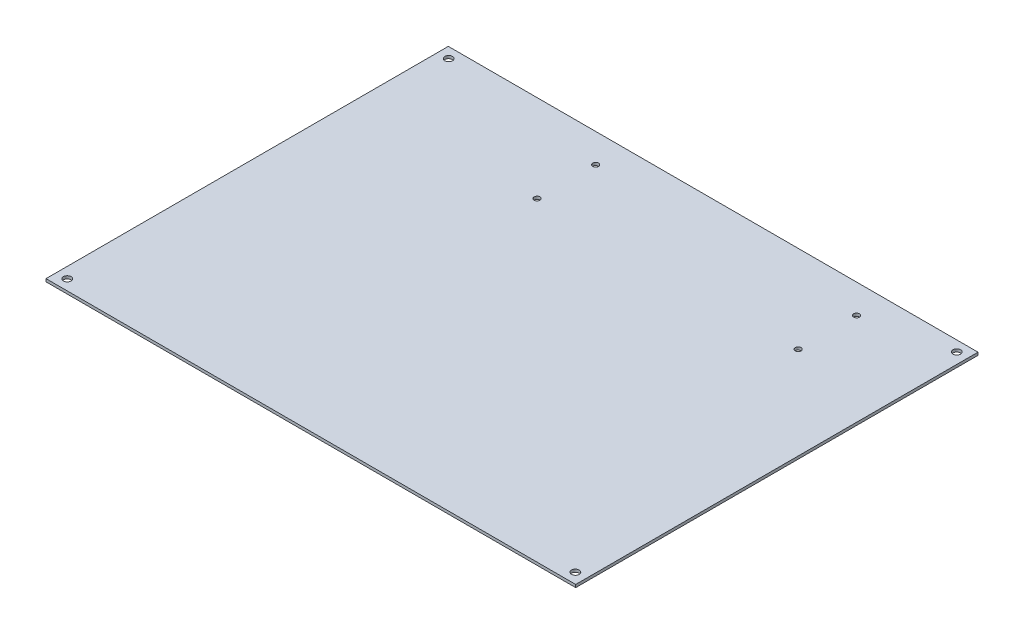
ISO-10303-21;
HEADER;
FILE_DESCRIPTION(('STEP AP214'),'2;1');
FILE_NAME('part.step','',(''),(''),'','','');
FILE_SCHEMA(('AUTOMOTIVE_DESIGN { 1 0 10303 214 1 1 1 1 }'));
ENDSEC;
DATA;
#1=APPLICATION_CONTEXT('core data for automotive mechanical design processes');
#2=APPLICATION_PROTOCOL_DEFINITION('international standard','automotive_design',2000,#1);
#3=PRODUCT_CONTEXT('',#1,'mechanical');
#4=PRODUCT('Part','Part','',(#3));
#5=PRODUCT_RELATED_PRODUCT_CATEGORY('part','',(#4));
#6=PRODUCT_DEFINITION_FORMATION('','',#4);
#7=PRODUCT_DEFINITION_CONTEXT('part definition',#1,'design');
#8=PRODUCT_DEFINITION('design','',#6,#7);
#9=PRODUCT_DEFINITION_SHAPE('','',#8);
#10=(LENGTH_UNIT() NAMED_UNIT(*) SI_UNIT(.MILLI.,.METRE.));
#11=(NAMED_UNIT(*) PLANE_ANGLE_UNIT() SI_UNIT($,.RADIAN.));
#12=(NAMED_UNIT(*) SI_UNIT($,.STERADIAN.) SOLID_ANGLE_UNIT());
#13=UNCERTAINTY_MEASURE_WITH_UNIT(LENGTH_MEASURE(1.E-05),#10,'distance_accuracy_value','');
#14=(GEOMETRIC_REPRESENTATION_CONTEXT(3) GLOBAL_UNCERTAINTY_ASSIGNED_CONTEXT((#13)) GLOBAL_UNIT_ASSIGNED_CONTEXT((#10,
#11,#12)) REPRESENTATION_CONTEXT('',''));
#15=CARTESIAN_POINT('',(0.,0.,0.));
#16=DIRECTION('',(0.,0.,1.));
#17=DIRECTION('',(1.,0.,0.));
#18=AXIS2_PLACEMENT_3D('',#15,#16,#17);
#19=CARTESIAN_POINT('',(-190.25,2.,-144.5));
#20=DIRECTION('',(1.,0.,0.));
#21=DIRECTION('',(0.,0.,-1.));
#22=AXIS2_PLACEMENT_3D('',#19,#20,#21);
#23=PLANE('',#22);
#24=DIRECTION('',(0.,0.,1.));
#25=VECTOR('',#24,1.);
#26=CARTESIAN_POINT('',(-190.25,0.,-144.5));
#27=LINE('',#26,#25);
#28=CARTESIAN_POINT('',(-190.25,0.,-144.5));
#29=VERTEX_POINT('',#28);
#30=CARTESIAN_POINT('',(-190.25,0.,144.5));
#31=VERTEX_POINT('',#30);
#32=EDGE_CURVE('E95',#29,#31,#27,.T.);
#33=ORIENTED_EDGE('',*,*,#32,.T.);
#34=DIRECTION('',(0.,-1.,0.));
#35=VECTOR('',#34,1.);
#36=CARTESIAN_POINT('',(-190.25,2.,144.5));
#37=LINE('',#36,#35);
#38=CARTESIAN_POINT('',(-190.25,2.,144.5));
#39=VERTEX_POINT('',#38);
#40=EDGE_CURVE('E11',#39,#31,#37,.T.);
#41=ORIENTED_EDGE('',*,*,#40,.F.);
#42=DIRECTION('',(0.,0.,1.));
#43=VECTOR('',#42,1.);
#44=CARTESIAN_POINT('',(-190.25,2.,-144.5));
#45=LINE('',#44,#43);
#46=CARTESIAN_POINT('',(-190.25,2.,-144.5));
#47=VERTEX_POINT('',#46);
#48=EDGE_CURVE('E83',#47,#39,#45,.T.);
#49=ORIENTED_EDGE('',*,*,#48,.F.);
#50=DIRECTION('',(0.,-1.,0.));
#51=VECTOR('',#50,1.);
#52=CARTESIAN_POINT('',(-190.25,2.,-144.5));
#53=LINE('',#52,#51);
#54=EDGE_CURVE('E91',#47,#29,#53,.T.);
#55=ORIENTED_EDGE('',*,*,#54,.T.);
#56=EDGE_LOOP('',(#33,#41,#49,#55));
#57=FACE_BOUND('',#56,.T.);
#58=ADVANCED_FACE('F32',(#57),#23,.F.);
#59=CARTESIAN_POINT('',(-190.25,2.,144.5));
#60=DIRECTION('',(0.,0.,-1.));
#61=DIRECTION('',(-1.,0.,0.));
#62=AXIS2_PLACEMENT_3D('',#59,#60,#61);
#63=PLANE('',#62);
#64=DIRECTION('',(1.,0.,0.));
#65=VECTOR('',#64,1.);
#66=CARTESIAN_POINT('',(-190.25,0.,144.5));
#67=LINE('',#66,#65);
#68=CARTESIAN_POINT('',(190.25,0.,144.5));
#69=VERTEX_POINT('',#68);
#70=EDGE_CURVE('E87',#31,#69,#67,.T.);
#71=ORIENTED_EDGE('',*,*,#70,.T.);
#72=DIRECTION('',(0.,-1.,0.));
#73=VECTOR('',#72,1.);
#74=CARTESIAN_POINT('',(190.25,2.,144.5));
#75=LINE('',#74,#73);
#76=CARTESIAN_POINT('',(190.25,2.,144.5));
#77=VERTEX_POINT('',#76);
#78=EDGE_CURVE('E40',#77,#69,#75,.T.);
#79=ORIENTED_EDGE('',*,*,#78,.F.);
#80=DIRECTION('',(1.,0.,0.));
#81=VECTOR('',#80,1.);
#82=CARTESIAN_POINT('',(-190.25,2.,144.5));
#83=LINE('',#82,#81);
#84=EDGE_CURVE('E78',#39,#77,#83,.T.);
#85=ORIENTED_EDGE('',*,*,#84,.F.);
#86=ORIENTED_EDGE('',*,*,#40,.T.);
#87=EDGE_LOOP('',(#71,#79,#85,#86));
#88=FACE_BOUND('',#87,.T.);
#89=ADVANCED_FACE('F86',(#88),#63,.F.);
#90=CARTESIAN_POINT('',(190.25,2.,-144.5));
#91=DIRECTION('',(-1.,0.,0.));
#92=DIRECTION('',(0.,0.,1.));
#93=AXIS2_PLACEMENT_3D('',#90,#91,#92);
#94=PLANE('',#93);
#95=DIRECTION('',(0.,0.,-1.));
#96=VECTOR('',#95,1.);
#97=CARTESIAN_POINT('',(190.25,0.,-144.5));
#98=LINE('',#97,#96);
#99=CARTESIAN_POINT('',(190.25,0.,-144.5));
#100=VERTEX_POINT('',#99);
#101=EDGE_CURVE('E65',#69,#100,#98,.T.);
#102=ORIENTED_EDGE('',*,*,#101,.T.);
#103=DIRECTION('',(0.,-1.,0.));
#104=VECTOR('',#103,1.);
#105=CARTESIAN_POINT('',(190.25,2.,-144.5));
#106=LINE('',#105,#104);
#107=CARTESIAN_POINT('',(190.25,2.,-144.5));
#108=VERTEX_POINT('',#107);
#109=EDGE_CURVE('E88',#108,#100,#106,.T.);
#110=ORIENTED_EDGE('',*,*,#109,.F.);
#111=DIRECTION('',(0.,0.,-1.));
#112=VECTOR('',#111,1.);
#113=CARTESIAN_POINT('',(190.25,2.,-144.5));
#114=LINE('',#113,#112);
#115=EDGE_CURVE('E81',#77,#108,#114,.T.);
#116=ORIENTED_EDGE('',*,*,#115,.F.);
#117=ORIENTED_EDGE('',*,*,#78,.T.);
#118=EDGE_LOOP('',(#102,#110,#116,#117));
#119=FACE_BOUND('',#118,.T.);
#120=ADVANCED_FACE('F89',(#119),#94,.F.);
#121=CARTESIAN_POINT('',(-190.25,2.,-144.5));
#122=DIRECTION('',(0.,0.,1.));
#123=DIRECTION('',(1.,0.,0.));
#124=AXIS2_PLACEMENT_3D('',#121,#122,#123);
#125=PLANE('',#124);
#126=DIRECTION('',(-1.,0.,0.));
#127=VECTOR('',#126,1.);
#128=CARTESIAN_POINT('',(-190.25,0.,-144.5));
#129=LINE('',#128,#127);
#130=EDGE_CURVE('E71',#100,#29,#129,.T.);
#131=ORIENTED_EDGE('',*,*,#130,.T.);
#132=ORIENTED_EDGE('',*,*,#54,.F.);
#133=DIRECTION('',(-1.,0.,0.));
#134=VECTOR('',#133,1.);
#135=CARTESIAN_POINT('',(-190.25,2.,-144.5));
#136=LINE('',#135,#134);
#137=EDGE_CURVE('E48',#108,#47,#136,.T.);
#138=ORIENTED_EDGE('',*,*,#137,.F.);
#139=ORIENTED_EDGE('',*,*,#109,.T.);
#140=EDGE_LOOP('',(#131,#132,#138,#139));
#141=FACE_BOUND('',#140,.T.);
#142=ADVANCED_FACE('F103',(#141),#125,.F.);
#143=CARTESIAN_POINT('',(0.,2.,0.));
#144=DIRECTION('',(0.,1.,0.));
#145=DIRECTION('',(0.,0.,1.));
#146=AXIS2_PLACEMENT_3D('',#143,#144,#145);
#147=PLANE('',#146);
#148=CARTESIAN_POINT('',(-63.6709117124881,2.,-123.724418586917));
#149=DIRECTION('',(0.,1.,0.));
#150=DIRECTION('',(0.,0.,1.));
#151=AXIS2_PLACEMENT_3D('',#148,#149,#150);
#152=CIRCLE('',#151,2.09999999999999);
#153=CARTESIAN_POINT('',(-63.6709117124881,2.,-121.624418586917));
#154=VERTEX_POINT('',#153);
#155=EDGE_CURVE('E153',#154,#154,#152,.T.);
#156=ORIENTED_EDGE('',*,*,#155,.F.);
#157=EDGE_LOOP('',(#156));
#158=FACE_BOUND('',#157,.T.);
#159=CARTESIAN_POINT('',(-63.67091146538,2.,-81.7199747935807));
#160=DIRECTION('',(0.,1.,0.));
#161=DIRECTION('',(0.,0.,1.));
#162=AXIS2_PLACEMENT_3D('',#159,#160,#161);
#163=CIRCLE('',#162,2.09999999999999);
#164=CARTESIAN_POINT('',(-63.67091146538,2.,-79.6199747935807));
#165=VERTEX_POINT('',#164);
#166=EDGE_CURVE('E147',#165,#165,#163,.T.);
#167=ORIENTED_EDGE('',*,*,#166,.F.);
#168=EDGE_LOOP('',(#167));
#169=FACE_BOUND('',#168,.T.);
#170=CARTESIAN_POINT('',(123.822278546739,2.,-81.7081784135397));
#171=DIRECTION('',(0.,1.,0.));
#172=DIRECTION('',(0.,0.,1.));
#173=AXIS2_PLACEMENT_3D('',#170,#171,#172);
#174=CIRCLE('',#173,2.09999999999999);
#175=CARTESIAN_POINT('',(123.822278546739,2.,-79.6081784135397));
#176=VERTEX_POINT('',#175);
#177=EDGE_CURVE('E141',#176,#176,#174,.T.);
#178=ORIENTED_EDGE('',*,*,#177,.F.);
#179=EDGE_LOOP('',(#178));
#180=FACE_BOUND('',#179,.T.);
#181=CARTESIAN_POINT('',(123.822278299631,2.,-123.712622206876));
#182=DIRECTION('',(0.,1.,0.));
#183=DIRECTION('',(0.,0.,1.));
#184=AXIS2_PLACEMENT_3D('',#181,#182,#183);
#185=CIRCLE('',#184,2.09999999999999);
#186=CARTESIAN_POINT('',(123.822278299631,2.,-121.612622206876));
#187=VERTEX_POINT('',#186);
#188=EDGE_CURVE('E135',#187,#187,#185,.T.);
#189=ORIENTED_EDGE('',*,*,#188,.F.);
#190=EDGE_LOOP('',(#189));
#191=FACE_BOUND('',#190,.T.);
#192=CARTESIAN_POINT('',(-182.5,2.,-137.));
#193=DIRECTION('',(0.,1.,0.));
#194=DIRECTION('',(0.,0.,1.));
#195=AXIS2_PLACEMENT_3D('',#192,#193,#194);
#196=CIRCLE('',#195,2.74999999999997);
#197=CARTESIAN_POINT('',(-182.5,2.,-134.25));
#198=VERTEX_POINT('',#197);
#199=EDGE_CURVE('E129',#198,#198,#196,.T.);
#200=ORIENTED_EDGE('',*,*,#199,.F.);
#201=EDGE_LOOP('',(#200));
#202=FACE_BOUND('',#201,.T.);
#203=CARTESIAN_POINT('',(-182.5,2.,137.));
#204=DIRECTION('',(0.,1.,0.));
#205=DIRECTION('',(0.,0.,1.));
#206=AXIS2_PLACEMENT_3D('',#203,#204,#205);
#207=CIRCLE('',#206,2.74999999999997);
#208=CARTESIAN_POINT('',(-182.5,2.,139.75));
#209=VERTEX_POINT('',#208);
#210=EDGE_CURVE('E123',#209,#209,#207,.T.);
#211=ORIENTED_EDGE('',*,*,#210,.F.);
#212=EDGE_LOOP('',(#211));
#213=FACE_BOUND('',#212,.T.);
#214=CARTESIAN_POINT('',(182.5,2.,137.));
#215=DIRECTION('',(0.,1.,0.));
#216=DIRECTION('',(0.,0.,1.));
#217=AXIS2_PLACEMENT_3D('',#214,#215,#216);
#218=CIRCLE('',#217,2.74999999999997);
#219=CARTESIAN_POINT('',(182.5,2.,139.75));
#220=VERTEX_POINT('',#219);
#221=EDGE_CURVE('E117',#220,#220,#218,.T.);
#222=ORIENTED_EDGE('',*,*,#221,.F.);
#223=EDGE_LOOP('',(#222));
#224=FACE_BOUND('',#223,.T.);
#225=CARTESIAN_POINT('',(182.5,2.,-137.));
#226=DIRECTION('',(0.,1.,0.));
#227=DIRECTION('',(0.,0.,1.));
#228=AXIS2_PLACEMENT_3D('',#225,#226,#227);
#229=CIRCLE('',#228,2.74999999999997);
#230=CARTESIAN_POINT('',(182.5,2.,-134.25));
#231=VERTEX_POINT('',#230);
#232=EDGE_CURVE('E111',#231,#231,#229,.T.);
#233=ORIENTED_EDGE('',*,*,#232,.F.);
#234=EDGE_LOOP('',(#233));
#235=FACE_BOUND('',#234,.T.);
#236=ORIENTED_EDGE('',*,*,#48,.T.);
#237=ORIENTED_EDGE('',*,*,#84,.T.);
#238=ORIENTED_EDGE('',*,*,#115,.T.);
#239=ORIENTED_EDGE('',*,*,#137,.T.);
#240=EDGE_LOOP('',(#236,#237,#238,#239));
#241=FACE_BOUND('',#240,.T.);
#242=ADVANCED_FACE('F79',(#158,#169,#180,#191,#202,#213,#224,#235,#241),#147,.T.);
#243=CARTESIAN_POINT('',(0.,0.,0.));
#244=DIRECTION('',(0.,1.,0.));
#245=DIRECTION('',(0.,0.,1.));
#246=AXIS2_PLACEMENT_3D('',#243,#244,#245);
#247=PLANE('',#246);
#248=CARTESIAN_POINT('',(-63.6709117124881,0.,-123.724418586917));
#249=DIRECTION('',(0.,1.,0.));
#250=DIRECTION('',(0.,0.,1.));
#251=AXIS2_PLACEMENT_3D('',#248,#249,#250);
#252=CIRCLE('',#251,2.1);
#253=CARTESIAN_POINT('',(-63.6709117124881,0.,-121.624418586917));
#254=VERTEX_POINT('',#253);
#255=EDGE_CURVE('E150',#254,#254,#252,.T.);
#256=ORIENTED_EDGE('',*,*,#255,.T.);
#257=EDGE_LOOP('',(#256));
#258=FACE_BOUND('',#257,.T.);
#259=CARTESIAN_POINT('',(-63.67091146538,0.,-81.7199747935807));
#260=DIRECTION('',(0.,1.,0.));
#261=DIRECTION('',(0.,0.,1.));
#262=AXIS2_PLACEMENT_3D('',#259,#260,#261);
#263=CIRCLE('',#262,2.1);
#264=CARTESIAN_POINT('',(-63.67091146538,0.,-79.6199747935807));
#265=VERTEX_POINT('',#264);
#266=EDGE_CURVE('E144',#265,#265,#263,.T.);
#267=ORIENTED_EDGE('',*,*,#266,.T.);
#268=EDGE_LOOP('',(#267));
#269=FACE_BOUND('',#268,.T.);
#270=CARTESIAN_POINT('',(123.822278546739,0.,-81.7081784135397));
#271=DIRECTION('',(0.,1.,0.));
#272=DIRECTION('',(0.,0.,1.));
#273=AXIS2_PLACEMENT_3D('',#270,#271,#272);
#274=CIRCLE('',#273,2.09999999999999);
#275=CARTESIAN_POINT('',(123.822278546739,0.,-79.6081784135397));
#276=VERTEX_POINT('',#275);
#277=EDGE_CURVE('E138',#276,#276,#274,.T.);
#278=ORIENTED_EDGE('',*,*,#277,.T.);
#279=EDGE_LOOP('',(#278));
#280=FACE_BOUND('',#279,.T.);
#281=CARTESIAN_POINT('',(123.822278299631,0.,-123.712622206876));
#282=DIRECTION('',(0.,1.,0.));
#283=DIRECTION('',(0.,0.,1.));
#284=AXIS2_PLACEMENT_3D('',#281,#282,#283);
#285=CIRCLE('',#284,2.09999999999999);
#286=CARTESIAN_POINT('',(123.822278299631,0.,-121.612622206876));
#287=VERTEX_POINT('',#286);
#288=EDGE_CURVE('E132',#287,#287,#285,.T.);
#289=ORIENTED_EDGE('',*,*,#288,.T.);
#290=EDGE_LOOP('',(#289));
#291=FACE_BOUND('',#290,.T.);
#292=CARTESIAN_POINT('',(-182.5,0.,-137.));
#293=DIRECTION('',(0.,1.,0.));
#294=DIRECTION('',(0.,0.,1.));
#295=AXIS2_PLACEMENT_3D('',#292,#293,#294);
#296=CIRCLE('',#295,2.75);
#297=CARTESIAN_POINT('',(-182.5,0.,-134.25));
#298=VERTEX_POINT('',#297);
#299=EDGE_CURVE('E126',#298,#298,#296,.T.);
#300=ORIENTED_EDGE('',*,*,#299,.T.);
#301=EDGE_LOOP('',(#300));
#302=FACE_BOUND('',#301,.T.);
#303=CARTESIAN_POINT('',(-182.5,0.,137.));
#304=DIRECTION('',(0.,1.,0.));
#305=DIRECTION('',(0.,0.,1.));
#306=AXIS2_PLACEMENT_3D('',#303,#304,#305);
#307=CIRCLE('',#306,2.75);
#308=CARTESIAN_POINT('',(-182.5,0.,139.75));
#309=VERTEX_POINT('',#308);
#310=EDGE_CURVE('E120',#309,#309,#307,.T.);
#311=ORIENTED_EDGE('',*,*,#310,.T.);
#312=EDGE_LOOP('',(#311));
#313=FACE_BOUND('',#312,.T.);
#314=CARTESIAN_POINT('',(182.5,0.,137.));
#315=DIRECTION('',(0.,1.,0.));
#316=DIRECTION('',(0.,0.,1.));
#317=AXIS2_PLACEMENT_3D('',#314,#315,#316);
#318=CIRCLE('',#317,2.75);
#319=CARTESIAN_POINT('',(182.5,0.,139.75));
#320=VERTEX_POINT('',#319);
#321=EDGE_CURVE('E114',#320,#320,#318,.T.);
#322=ORIENTED_EDGE('',*,*,#321,.T.);
#323=EDGE_LOOP('',(#322));
#324=FACE_BOUND('',#323,.T.);
#325=CARTESIAN_POINT('',(182.5,0.,-137.));
#326=DIRECTION('',(0.,1.,0.));
#327=DIRECTION('',(0.,0.,1.));
#328=AXIS2_PLACEMENT_3D('',#325,#326,#327);
#329=CIRCLE('',#328,2.75);
#330=CARTESIAN_POINT('',(182.5,0.,-134.25));
#331=VERTEX_POINT('',#330);
#332=EDGE_CURVE('E98',#331,#331,#329,.T.);
#333=ORIENTED_EDGE('',*,*,#332,.T.);
#334=EDGE_LOOP('',(#333));
#335=FACE_BOUND('',#334,.T.);
#336=ORIENTED_EDGE('',*,*,#32,.F.);
#337=ORIENTED_EDGE('',*,*,#130,.F.);
#338=ORIENTED_EDGE('',*,*,#101,.F.);
#339=ORIENTED_EDGE('',*,*,#70,.F.);
#340=EDGE_LOOP('',(#336,#337,#338,#339));
#341=FACE_BOUND('',#340,.T.);
#342=ADVANCED_FACE('F106',(#258,#269,#280,#291,#302,#313,#324,#335,#341),#247,.F.);
#343=CARTESIAN_POINT('',(182.5,2.,-137.));
#344=DIRECTION('',(0.,1.,0.));
#345=DIRECTION('',(0.,0.,1.));
#346=AXIS2_PLACEMENT_3D('',#343,#344,#345);
#347=CYLINDRICAL_SURFACE('',#346,2.74999999999999);
#348=ORIENTED_EDGE('',*,*,#332,.F.);
#349=EDGE_LOOP('',(#348));
#350=FACE_BOUND('',#349,.T.);
#351=ORIENTED_EDGE('',*,*,#232,.T.);
#352=EDGE_LOOP('',(#351));
#353=FACE_BOUND('',#352,.T.);
#354=ADVANCED_FACE('F176',(#350,#353),#347,.F.);
#355=CARTESIAN_POINT('',(182.5,2.,137.));
#356=DIRECTION('',(0.,1.,0.));
#357=DIRECTION('',(0.,0.,1.));
#358=AXIS2_PLACEMENT_3D('',#355,#356,#357);
#359=CYLINDRICAL_SURFACE('',#358,2.74999999999999);
#360=ORIENTED_EDGE('',*,*,#321,.F.);
#361=EDGE_LOOP('',(#360));
#362=FACE_BOUND('',#361,.T.);
#363=ORIENTED_EDGE('',*,*,#221,.T.);
#364=EDGE_LOOP('',(#363));
#365=FACE_BOUND('',#364,.T.);
#366=ADVANCED_FACE('F178',(#362,#365),#359,.F.);
#367=CARTESIAN_POINT('',(-182.5,2.,137.));
#368=DIRECTION('',(0.,1.,0.));
#369=DIRECTION('',(0.,0.,1.));
#370=AXIS2_PLACEMENT_3D('',#367,#368,#369);
#371=CYLINDRICAL_SURFACE('',#370,2.74999999999999);
#372=ORIENTED_EDGE('',*,*,#310,.F.);
#373=EDGE_LOOP('',(#372));
#374=FACE_BOUND('',#373,.T.);
#375=ORIENTED_EDGE('',*,*,#210,.T.);
#376=EDGE_LOOP('',(#375));
#377=FACE_BOUND('',#376,.T.);
#378=ADVANCED_FACE('F185',(#374,#377),#371,.F.);
#379=CARTESIAN_POINT('',(-182.5,2.,-137.));
#380=DIRECTION('',(0.,1.,0.));
#381=DIRECTION('',(0.,0.,1.));
#382=AXIS2_PLACEMENT_3D('',#379,#380,#381);
#383=CYLINDRICAL_SURFACE('',#382,2.74999999999999);
#384=ORIENTED_EDGE('',*,*,#299,.F.);
#385=EDGE_LOOP('',(#384));
#386=FACE_BOUND('',#385,.T.);
#387=ORIENTED_EDGE('',*,*,#199,.T.);
#388=EDGE_LOOP('',(#387));
#389=FACE_BOUND('',#388,.T.);
#390=ADVANCED_FACE('F226',(#386,#389),#383,.F.);
#391=CARTESIAN_POINT('',(123.822278299631,2.,-123.712622206876));
#392=DIRECTION('',(0.,1.,0.));
#393=DIRECTION('',(0.,0.,1.));
#394=AXIS2_PLACEMENT_3D('',#391,#392,#393);
#395=CYLINDRICAL_SURFACE('',#394,2.09999999999999);
#396=ORIENTED_EDGE('',*,*,#288,.F.);
#397=EDGE_LOOP('',(#396));
#398=FACE_BOUND('',#397,.T.);
#399=ORIENTED_EDGE('',*,*,#188,.T.);
#400=EDGE_LOOP('',(#399));
#401=FACE_BOUND('',#400,.T.);
#402=ADVANCED_FACE('F220',(#398,#401),#395,.F.);
#403=CARTESIAN_POINT('',(123.822278546739,2.,-81.7081784135397));
#404=DIRECTION('',(0.,1.,0.));
#405=DIRECTION('',(0.,0.,1.));
#406=AXIS2_PLACEMENT_3D('',#403,#404,#405);
#407=CYLINDRICAL_SURFACE('',#406,2.09999999999999);
#408=ORIENTED_EDGE('',*,*,#277,.F.);
#409=EDGE_LOOP('',(#408));
#410=FACE_BOUND('',#409,.T.);
#411=ORIENTED_EDGE('',*,*,#177,.T.);
#412=EDGE_LOOP('',(#411));
#413=FACE_BOUND('',#412,.T.);
#414=ADVANCED_FACE('F225',(#410,#413),#407,.F.);
#415=CARTESIAN_POINT('',(-63.67091146538,2.,-81.7199747935807));
#416=DIRECTION('',(0.,1.,0.));
#417=DIRECTION('',(0.,0.,1.));
#418=AXIS2_PLACEMENT_3D('',#415,#416,#417);
#419=CYLINDRICAL_SURFACE('',#418,2.09999999999999);
#420=ORIENTED_EDGE('',*,*,#266,.F.);
#421=EDGE_LOOP('',(#420));
#422=FACE_BOUND('',#421,.T.);
#423=ORIENTED_EDGE('',*,*,#166,.T.);
#424=EDGE_LOOP('',(#423));
#425=FACE_BOUND('',#424,.T.);
#426=ADVANCED_FACE('F238',(#422,#425),#419,.F.);
#427=CARTESIAN_POINT('',(-63.6709117124881,2.,-123.724418586917));
#428=DIRECTION('',(0.,1.,0.));
#429=DIRECTION('',(0.,0.,1.));
#430=AXIS2_PLACEMENT_3D('',#427,#428,#429);
#431=CYLINDRICAL_SURFACE('',#430,2.09999999999999);
#432=ORIENTED_EDGE('',*,*,#255,.F.);
#433=EDGE_LOOP('',(#432));
#434=FACE_BOUND('',#433,.T.);
#435=ORIENTED_EDGE('',*,*,#155,.T.);
#436=EDGE_LOOP('',(#435));
#437=FACE_BOUND('',#436,.T.);
#438=ADVANCED_FACE('F157',(#434,#437),#431,.F.);
#439=CLOSED_SHELL('',(#58,#89,#120,#142,#242,#342,#354,#366,#378,#390,#402,#414,#426,#438));
#440=MANIFOLD_SOLID_BREP('B2',#439);
#441=ADVANCED_BREP_SHAPE_REPRESENTATION('',(#18,#440),#14);
#442=SHAPE_DEFINITION_REPRESENTATION(#9,#441);
ENDSEC;
END-ISO-10303-21;
